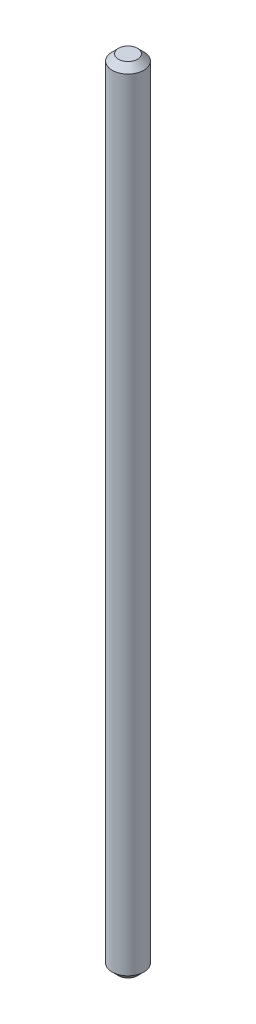
ISO-10303-21;
HEADER;
FILE_DESCRIPTION(('STEP AP214'),'2;1');
FILE_NAME('part.step','',(''),(''),'','','');
FILE_SCHEMA(('AUTOMOTIVE_DESIGN { 1 0 10303 214 1 1 1 1 }'));
ENDSEC;
DATA;
#1=APPLICATION_CONTEXT('core data for automotive mechanical design processes');
#2=APPLICATION_PROTOCOL_DEFINITION('international standard','automotive_design',2000,#1);
#3=PRODUCT_CONTEXT('',#1,'mechanical');
#4=PRODUCT('Part','Part','',(#3));
#5=PRODUCT_RELATED_PRODUCT_CATEGORY('part','',(#4));
#6=PRODUCT_DEFINITION_FORMATION('','',#4);
#7=PRODUCT_DEFINITION_CONTEXT('part definition',#1,'design');
#8=PRODUCT_DEFINITION('design','',#6,#7);
#9=PRODUCT_DEFINITION_SHAPE('','',#8);
#10=(LENGTH_UNIT() NAMED_UNIT(*) SI_UNIT(.MILLI.,.METRE.));
#11=(NAMED_UNIT(*) PLANE_ANGLE_UNIT() SI_UNIT($,.RADIAN.));
#12=(NAMED_UNIT(*) SI_UNIT($,.STERADIAN.) SOLID_ANGLE_UNIT());
#13=UNCERTAINTY_MEASURE_WITH_UNIT(LENGTH_MEASURE(1.E-05),#10,'distance_accuracy_value','');
#14=(GEOMETRIC_REPRESENTATION_CONTEXT(3) GLOBAL_UNCERTAINTY_ASSIGNED_CONTEXT((#13)) GLOBAL_UNIT_ASSIGNED_CONTEXT((#10,
#11,#12)) REPRESENTATION_CONTEXT('',''));
#15=CARTESIAN_POINT('',(0.,0.,0.));
#16=DIRECTION('',(0.,0.,1.));
#17=DIRECTION('',(1.,0.,0.));
#18=AXIS2_PLACEMENT_3D('',#15,#16,#17);
#19=CARTESIAN_POINT('',(0.,250.,0.));
#20=DIRECTION('',(0.,-1.,0.));
#21=DIRECTION('',(0.,0.,-1.));
#22=AXIS2_PLACEMENT_3D('',#19,#20,#21);
#23=CYLINDRICAL_SURFACE('',#22,5.);
#24=CARTESIAN_POINT('',(0.,1.99999999999997,0.));
#25=DIRECTION('',(0.,1.,0.));
#26=DIRECTION('',(0.,0.,1.));
#27=AXIS2_PLACEMENT_3D('',#24,#25,#26);
#28=CIRCLE('',#27,5.);
#29=CARTESIAN_POINT('',(0.,1.99999999999997,5.));
#30=VERTEX_POINT('',#29);
#31=EDGE_CURVE('E42',#30,#30,#28,.T.);
#32=ORIENTED_EDGE('',*,*,#31,.T.);
#33=EDGE_LOOP('',(#32));
#34=FACE_BOUND('',#33,.T.);
#35=CARTESIAN_POINT('',(0.,248.,0.));
#36=DIRECTION('',(0.,1.,0.));
#37=DIRECTION('',(0.,0.,1.));
#38=AXIS2_PLACEMENT_3D('',#35,#36,#37);
#39=CIRCLE('',#38,5.);
#40=CARTESIAN_POINT('',(0.,248.,5.));
#41=VERTEX_POINT('',#40);
#42=EDGE_CURVE('E46',#41,#41,#39,.F.);
#43=ORIENTED_EDGE('',*,*,#42,.T.);
#44=EDGE_LOOP('',(#43));
#45=FACE_BOUND('',#44,.T.);
#46=ADVANCED_FACE('F31',(#34,#45),#23,.T.);
#47=CARTESIAN_POINT('',(0.,250.,0.));
#48=DIRECTION('',(0.,1.,0.));
#49=DIRECTION('',(0.,0.,1.));
#50=AXIS2_PLACEMENT_3D('',#47,#48,#49);
#51=PLANE('',#50);
#52=CARTESIAN_POINT('',(0.,250.,0.));
#53=DIRECTION('',(0.,1.,0.));
#54=DIRECTION('',(0.,0.,1.));
#55=AXIS2_PLACEMENT_3D('',#52,#53,#54);
#56=CIRCLE('',#55,3.00000000000003);
#57=CARTESIAN_POINT('',(0.,250.,3.00000000000003));
#58=VERTEX_POINT('',#57);
#59=EDGE_CURVE('E10',#58,#58,#56,.T.);
#60=ORIENTED_EDGE('',*,*,#59,.T.);
#61=EDGE_LOOP('',(#60));
#62=FACE_BOUND('',#61,.T.);
#63=ADVANCED_FACE('F62',(#62),#51,.T.);
#64=CARTESIAN_POINT('',(0.,0.,0.));
#65=DIRECTION('',(0.,1.,0.));
#66=DIRECTION('',(0.,0.,1.));
#67=AXIS2_PLACEMENT_3D('',#64,#65,#66);
#68=PLANE('',#67);
#69=CARTESIAN_POINT('',(0.,0.,0.));
#70=DIRECTION('',(0.,1.,0.));
#71=DIRECTION('',(0.,0.,1.));
#72=AXIS2_PLACEMENT_3D('',#69,#70,#71);
#73=CIRCLE('',#72,3.00000000000006);
#74=CARTESIAN_POINT('',(0.,0.,3.00000000000006));
#75=VERTEX_POINT('',#74);
#76=EDGE_CURVE('E38',#75,#75,#73,.F.);
#77=ORIENTED_EDGE('',*,*,#76,.T.);
#78=EDGE_LOOP('',(#77));
#79=FACE_BOUND('',#78,.T.);
#80=ADVANCED_FACE('F59',(#79),#68,.F.);
#81=CARTESIAN_POINT('',(0.,1.99999999999997,0.));
#82=DIRECTION('',(0.,1.,0.));
#83=DIRECTION('',(0.,0.,1.));
#84=AXIS2_PLACEMENT_3D('',#81,#82,#83);
#85=CONICAL_SURFACE('',#84,5.,0.78539816339744);
#86=ORIENTED_EDGE('',*,*,#76,.F.);
#87=EDGE_LOOP('',(#86));
#88=FACE_BOUND('',#87,.T.);
#89=ORIENTED_EDGE('',*,*,#31,.F.);
#90=EDGE_LOOP('',(#89));
#91=FACE_BOUND('',#90,.T.);
#92=ADVANCED_FACE('F55',(#88,#91),#85,.T.);
#93=CARTESIAN_POINT('',(0.,250.,0.));
#94=DIRECTION('',(0.,-1.,0.));
#95=DIRECTION('',(0.,0.,-1.));
#96=AXIS2_PLACEMENT_3D('',#93,#94,#95);
#97=CONICAL_SURFACE('',#96,3.00000000000003,0.785398163397447);
#98=ORIENTED_EDGE('',*,*,#42,.F.);
#99=EDGE_LOOP('',(#98));
#100=FACE_BOUND('',#99,.T.);
#101=ORIENTED_EDGE('',*,*,#59,.F.);
#102=EDGE_LOOP('',(#101));
#103=FACE_BOUND('',#102,.T.);
#104=ADVANCED_FACE('F33',(#100,#103),#97,.T.);
#105=CLOSED_SHELL('',(#46,#63,#80,#92,#104));
#106=MANIFOLD_SOLID_BREP('B2',#105);
#107=ADVANCED_BREP_SHAPE_REPRESENTATION('',(#18,#106),#14);
#108=SHAPE_DEFINITION_REPRESENTATION(#9,#107);
ENDSEC;
END-ISO-10303-21;
